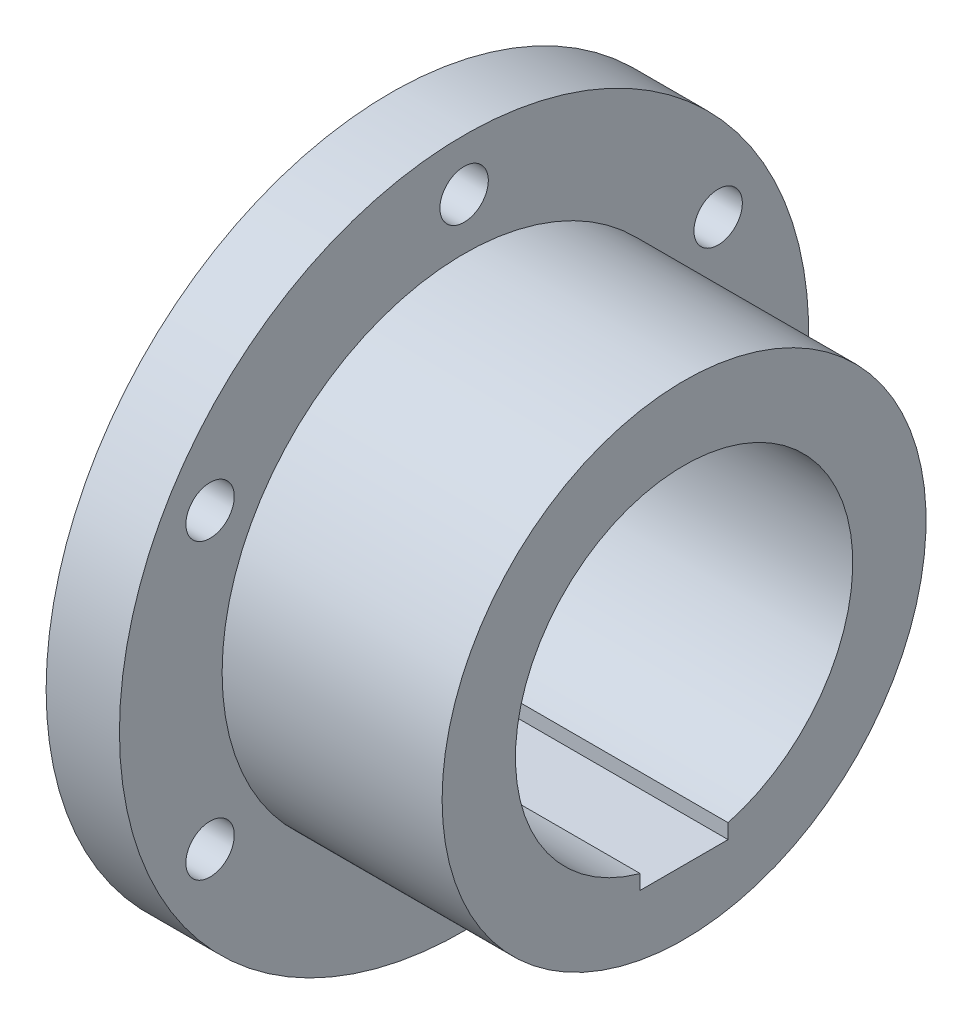
ISO-10303-21;
HEADER;
FILE_DESCRIPTION(('STEP AP214'),'2;1');
FILE_NAME('part.step','',(''),(''),'','','');
FILE_SCHEMA(('AUTOMOTIVE_DESIGN { 1 0 10303 214 1 1 1 1 }'));
ENDSEC;
DATA;
#1=APPLICATION_CONTEXT('core data for automotive mechanical design processes');
#2=APPLICATION_PROTOCOL_DEFINITION('international standard','automotive_design',2000,#1);
#3=PRODUCT_CONTEXT('',#1,'mechanical');
#4=PRODUCT('Part','Part','',(#3));
#5=PRODUCT_RELATED_PRODUCT_CATEGORY('part','',(#4));
#6=PRODUCT_DEFINITION_FORMATION('','',#4);
#7=PRODUCT_DEFINITION_CONTEXT('part definition',#1,'design');
#8=PRODUCT_DEFINITION('design','',#6,#7);
#9=PRODUCT_DEFINITION_SHAPE('','',#8);
#10=(LENGTH_UNIT() NAMED_UNIT(*) SI_UNIT(.MILLI.,.METRE.));
#11=(NAMED_UNIT(*) PLANE_ANGLE_UNIT() SI_UNIT($,.RADIAN.));
#12=(NAMED_UNIT(*) SI_UNIT($,.STERADIAN.) SOLID_ANGLE_UNIT());
#13=UNCERTAINTY_MEASURE_WITH_UNIT(LENGTH_MEASURE(1.E-05),#10,'distance_accuracy_value','');
#14=(GEOMETRIC_REPRESENTATION_CONTEXT(3) GLOBAL_UNCERTAINTY_ASSIGNED_CONTEXT((#13)) GLOBAL_UNIT_ASSIGNED_CONTEXT((#10,
#11,#12)) REPRESENTATION_CONTEXT('',''));
#15=CARTESIAN_POINT('',(0.,0.,0.));
#16=DIRECTION('',(0.,0.,1.));
#17=DIRECTION('',(1.,0.,0.));
#18=AXIS2_PLACEMENT_3D('',#15,#16,#17);
#19=CARTESIAN_POINT('',(9.2148511043888E-12,1.66533453693773E-13,-28.0000000000012));
#20=DIRECTION('',(1.,0.,0.));
#21=DIRECTION('',(0.,0.,-1.));
#22=AXIS2_PLACEMENT_3D('',#19,#20,#21);
#23=PLANE('',#22);
#24=DIRECTION('',(0.,0.,1.));
#25=VECTOR('',#24,1.);
#26=CARTESIAN_POINT('',(0.,-24.2036033111722,-6.00000000000106));
#27=LINE('',#26,#25);
#28=CARTESIAN_POINT('',(0.,-24.2036033111722,-6.00000000000106));
#29=VERTEX_POINT('',#28);
#30=CARTESIAN_POINT('',(4.66293670342566E-12,-24.2036033111722,5.99999999999928));
#31=VERTEX_POINT('',#30);
#32=EDGE_CURVE('E104',#29,#31,#27,.T.);
#33=ORIENTED_EDGE('',*,*,#32,.F.);
#34=DIRECTION('',(0.,-0.999999999999995,0.));
#35=VECTOR('',#34,1.);
#36=CARTESIAN_POINT('',(0.,-24.2036033111722,-6.00000000000106));
#37=LINE('',#36,#35);
#38=CARTESIAN_POINT('',(2.22044604925031E-13,-22.2036033111722,-6.00000000000114));
#39=VERTEX_POINT('',#38);
#40=EDGE_CURVE('E82',#39,#29,#37,.T.);
#41=ORIENTED_EDGE('',*,*,#40,.F.);
#42=CARTESIAN_POINT('',(0.,0.,0.));
#43=DIRECTION('',(-1.,0.,0.));
#44=DIRECTION('',(0.,0.,1.));
#45=AXIS2_PLACEMENT_3D('',#42,#43,#44);
#46=CIRCLE('',#45,23.);
#47=CARTESIAN_POINT('',(4.66293670342566E-12,-22.2036033111722,5.99999999999956));
#48=VERTEX_POINT('',#47);
#49=EDGE_CURVE('E11',#48,#39,#46,.T.);
#50=ORIENTED_EDGE('',*,*,#49,.F.);
#51=DIRECTION('',(0.,0.999999999999995,0.));
#52=VECTOR('',#51,1.);
#53=CARTESIAN_POINT('',(4.66293670342566E-12,-24.2036033111722,5.99999999999928));
#54=LINE('',#53,#52);
#55=EDGE_CURVE('E100',#31,#48,#54,.T.);
#56=ORIENTED_EDGE('',*,*,#55,.F.);
#57=EDGE_LOOP('',(#33,#41,#50,#56));
#58=FACE_BOUND('',#57,.T.);
#59=CARTESIAN_POINT('',(0.,0.,0.));
#60=DIRECTION('',(-1.,0.,0.));
#61=DIRECTION('',(0.,0.,1.));
#62=AXIS2_PLACEMENT_3D('',#59,#60,#61);
#63=CIRCLE('',#62,28.);
#64=CARTESIAN_POINT('',(0.,0.,28.));
#65=VERTEX_POINT('',#64);
#66=EDGE_CURVE('E169',#65,#65,#63,.T.);
#67=ORIENTED_EDGE('',*,*,#66,.T.);
#68=EDGE_LOOP('',(#67));
#69=FACE_BOUND('',#68,.T.);
#70=ADVANCED_FACE('F38',(#58,#69),#23,.F.);
#71=CARTESIAN_POINT('',(-31.1593830334144,0.,-6.38378239159465E-13));
#72=DIRECTION('',(-1.,0.,0.));
#73=DIRECTION('',(0.,0.,1.));
#74=AXIS2_PLACEMENT_3D('',#71,#72,#73);
#75=CYLINDRICAL_SURFACE('',#74,23.);
#76=ORIENTED_EDGE('',*,*,#49,.T.);
#77=DIRECTION('',(-1.,0.,0.));
#78=VECTOR('',#77,1.);
#79=CARTESIAN_POINT('',(46.0000000000046,-22.2036033111744,-6.00000000000145));
#80=LINE('',#79,#78);
#81=CARTESIAN_POINT('',(46.0000000000046,-22.2036033111744,-6.00000000000145));
#82=VERTEX_POINT('',#81);
#83=EDGE_CURVE('E77',#82,#39,#80,.T.);
#84=ORIENTED_EDGE('',*,*,#83,.F.);
#85=CARTESIAN_POINT('',(46.0000000000047,2.33146835171283E-12,-1.38777878078145E-12));
#86=DIRECTION('',(-1.,0.,0.));
#87=DIRECTION('',(0.,0.,1.));
#88=AXIS2_PLACEMENT_3D('',#85,#86,#87);
#89=CIRCLE('',#88,23.);
#90=CARTESIAN_POINT('',(46.0000000000047,-22.2036033111722,5.99999999999881));
#91=VERTEX_POINT('',#90);
#92=EDGE_CURVE('E46',#91,#82,#89,.T.);
#93=ORIENTED_EDGE('',*,*,#92,.F.);
#94=DIRECTION('',(-1.,0.,0.));
#95=VECTOR('',#94,1.);
#96=CARTESIAN_POINT('',(46.0000000000047,-22.2036033111722,5.99999999999881));
#97=LINE('',#96,#95);
#98=EDGE_CURVE('E116',#91,#48,#97,.T.);
#99=ORIENTED_EDGE('',*,*,#98,.T.);
#100=EDGE_LOOP('',(#76,#84,#93,#99));
#101=FACE_BOUND('',#100,.T.);
#102=ADVANCED_FACE('F223',(#101),#75,.F.);
#103=CARTESIAN_POINT('',(46.,2.33146835171283E-12,-23.0000000000007));
#104=DIRECTION('',(-1.,0.,0.));
#105=DIRECTION('',(0.,0.,1.));
#106=AXIS2_PLACEMENT_3D('',#103,#104,#105);
#107=PLANE('',#106);
#108=ORIENTED_EDGE('',*,*,#92,.T.);
#109=DIRECTION('',(0.,-0.999999999999995,0.));
#110=VECTOR('',#109,1.);
#111=CARTESIAN_POINT('',(46.0000000000046,-24.2036033111744,-6.00000000000034));
#112=LINE('',#111,#110);
#113=CARTESIAN_POINT('',(46.0000000000046,-24.2036033111744,-6.00000000000034));
#114=VERTEX_POINT('',#113);
#115=EDGE_CURVE('E62',#82,#114,#112,.T.);
#116=ORIENTED_EDGE('',*,*,#115,.T.);
#117=DIRECTION('',(0.,0.,1.));
#118=VECTOR('',#117,1.);
#119=CARTESIAN_POINT('',(46.0000000000046,-24.2036033111744,-6.00000000000034));
#120=LINE('',#119,#118);
#121=CARTESIAN_POINT('',(46.0000000000047,-24.2036033111722,5.9999999999997));
#122=VERTEX_POINT('',#121);
#123=EDGE_CURVE('E90',#114,#122,#120,.T.);
#124=ORIENTED_EDGE('',*,*,#123,.T.);
#125=DIRECTION('',(0.,0.999999999999995,0.));
#126=VECTOR('',#125,1.);
#127=CARTESIAN_POINT('',(46.0000000000047,-24.2036033111722,5.9999999999997));
#128=LINE('',#127,#126);
#129=EDGE_CURVE('E53',#122,#91,#128,.T.);
#130=ORIENTED_EDGE('',*,*,#129,.T.);
#131=EDGE_LOOP('',(#108,#116,#124,#130));
#132=FACE_BOUND('',#131,.T.);
#133=CARTESIAN_POINT('',(46.0000000000047,2.33146835171283E-12,-1.38777878078145E-12));
#134=DIRECTION('',(-1.,0.,0.));
#135=DIRECTION('',(0.,0.,1.));
#136=AXIS2_PLACEMENT_3D('',#133,#134,#135);
#137=CIRCLE('',#136,33.);
#138=CARTESIAN_POINT('',(46.0000000000047,2.33146835171283E-12,32.9999999999986));
#139=VERTEX_POINT('',#138);
#140=EDGE_CURVE('E189',#139,#139,#137,.T.);
#141=ORIENTED_EDGE('',*,*,#140,.F.);
#142=EDGE_LOOP('',(#141));
#143=FACE_BOUND('',#142,.T.);
#144=ADVANCED_FACE('F96',(#132,#143),#107,.F.);
#145=CARTESIAN_POINT('',(-31.1593830334144,0.,-6.38378239159465E-13));
#146=DIRECTION('',(-1.,0.,0.));
#147=DIRECTION('',(0.,0.,1.));
#148=AXIS2_PLACEMENT_3D('',#145,#146,#147);
#149=CYLINDRICAL_SURFACE('',#148,33.);
#150=CARTESIAN_POINT('',(16.0000000000041,2.33146835171283E-12,-3.88578058618805E-13));
#151=DIRECTION('',(-1.,0.,0.));
#152=DIRECTION('',(0.,0.,1.));
#153=AXIS2_PLACEMENT_3D('',#150,#151,#152);
#154=CIRCLE('',#153,33.);
#155=CARTESIAN_POINT('',(16.0000000000041,2.33146835171283E-12,32.9999999999996));
#156=VERTEX_POINT('',#155);
#157=EDGE_CURVE('E185',#156,#156,#154,.T.);
#158=ORIENTED_EDGE('',*,*,#157,.F.);
#159=EDGE_LOOP('',(#158));
#160=FACE_BOUND('',#159,.T.);
#161=ORIENTED_EDGE('',*,*,#140,.T.);
#162=EDGE_LOOP('',(#161));
#163=FACE_BOUND('',#162,.T.);
#164=ADVANCED_FACE('F221',(#160,#163),#149,.T.);
#165=CARTESIAN_POINT('',(16.,2.33146835171283E-12,-33.0000000000001));
#166=DIRECTION('',(-1.,0.,0.));
#167=DIRECTION('',(0.,0.,1.));
#168=AXIS2_PLACEMENT_3D('',#165,#166,#167);
#169=PLANE('',#168);
#170=CARTESIAN_POINT('',(16.0000000000041,40.0000000000024,-1.19348975147204E-12));
#171=DIRECTION('',(-1.,0.,0.));
#172=DIRECTION('',(0.,0.,1.));
#173=AXIS2_PLACEMENT_3D('',#170,#171,#172);
#174=CIRCLE('',#173,3.3);
#175=CARTESIAN_POINT('',(16.0000000000041,40.0000000000024,3.29999999999881));
#176=VERTEX_POINT('',#175);
#177=EDGE_CURVE('E165',#176,#176,#174,.T.);
#178=ORIENTED_EDGE('',*,*,#177,.T.);
#179=EDGE_LOOP('',(#178));
#180=FACE_BOUND('',#179,.T.);
#181=CARTESIAN_POINT('',(16.,20.0000000000006,-34.6410161513778));
#182=DIRECTION('',(-1.,0.,0.));
#183=DIRECTION('',(0.,0.,1.));
#184=AXIS2_PLACEMENT_3D('',#181,#182,#183);
#185=CIRCLE('',#184,3.3);
#186=CARTESIAN_POINT('',(16.,20.0000000000006,-31.3410161513778));
#187=VERTEX_POINT('',#186);
#188=EDGE_CURVE('E161',#187,#187,#185,.T.);
#189=ORIENTED_EDGE('',*,*,#188,.T.);
#190=EDGE_LOOP('',(#189));
#191=FACE_BOUND('',#190,.T.);
#192=CARTESIAN_POINT('',(16.0000000000009,-19.9999999999994,-34.6410161513761));
#193=DIRECTION('',(-1.,0.,0.));
#194=DIRECTION('',(0.,0.,1.));
#195=AXIS2_PLACEMENT_3D('',#192,#193,#194);
#196=CIRCLE('',#195,3.3);
#197=CARTESIAN_POINT('',(16.0000000000009,-19.9999999999994,-31.3410161513761));
#198=VERTEX_POINT('',#197);
#199=EDGE_CURVE('E157',#198,#198,#196,.T.);
#200=ORIENTED_EDGE('',*,*,#199,.T.);
#201=EDGE_LOOP('',(#200));
#202=FACE_BOUND('',#201,.T.);
#203=CARTESIAN_POINT('',(16.0000000000047,-39.9999999999976,3.38618022510673E-12));
#204=DIRECTION('',(-1.,0.,0.));
#205=DIRECTION('',(0.,0.,1.));
#206=AXIS2_PLACEMENT_3D('',#203,#204,#205);
#207=CIRCLE('',#206,3.3);
#208=CARTESIAN_POINT('',(16.0000000000047,-39.9999999999976,3.30000000000339));
#209=VERTEX_POINT('',#208);
#210=EDGE_CURVE('E153',#209,#209,#207,.T.);
#211=ORIENTED_EDGE('',*,*,#210,.T.);
#212=EDGE_LOOP('',(#211));
#213=FACE_BOUND('',#212,.T.);
#214=CARTESIAN_POINT('',(16.0000000000047,-19.999999999996,34.6410161513807));
#215=DIRECTION('',(-1.,0.,0.));
#216=DIRECTION('',(0.,0.,1.));
#217=AXIS2_PLACEMENT_3D('',#214,#215,#216);
#218=CIRCLE('',#217,3.3);
#219=CARTESIAN_POINT('',(16.0000000000047,-19.999999999996,37.9410161513807));
#220=VERTEX_POINT('',#219);
#221=EDGE_CURVE('E149',#220,#220,#218,.T.);
#222=ORIENTED_EDGE('',*,*,#221,.T.);
#223=EDGE_LOOP('',(#222));
#224=FACE_BOUND('',#223,.T.);
#225=CARTESIAN_POINT('',(16.0000000000047,20.000000000004,34.6410161513769));
#226=DIRECTION('',(-1.,0.,0.));
#227=DIRECTION('',(0.,0.,1.));
#228=AXIS2_PLACEMENT_3D('',#225,#226,#227);
#229=CIRCLE('',#228,3.3);
#230=CARTESIAN_POINT('',(16.0000000000047,20.000000000004,37.9410161513769));
#231=VERTEX_POINT('',#230);
#232=EDGE_CURVE('E126',#231,#231,#229,.T.);
#233=ORIENTED_EDGE('',*,*,#232,.T.);
#234=EDGE_LOOP('',(#233));
#235=FACE_BOUND('',#234,.T.);
#236=CARTESIAN_POINT('',(16.0000000000041,2.33146835171283E-12,-3.88578058618805E-13));
#237=DIRECTION('',(-1.,0.,0.));
#238=DIRECTION('',(0.,0.,1.));
#239=AXIS2_PLACEMENT_3D('',#236,#237,#238);
#240=CIRCLE('',#239,47.);
#241=CARTESIAN_POINT('',(16.0000000000041,2.33146835171283E-12,46.9999999999996));
#242=VERTEX_POINT('',#241);
#243=EDGE_CURVE('E181',#242,#242,#240,.T.);
#244=ORIENTED_EDGE('',*,*,#243,.F.);
#245=EDGE_LOOP('',(#244));
#246=FACE_BOUND('',#245,.T.);
#247=ORIENTED_EDGE('',*,*,#157,.T.);
#248=EDGE_LOOP('',(#247));
#249=FACE_BOUND('',#248,.T.);
#250=ADVANCED_FACE('F229',(#180,#191,#202,#213,#224,#235,#246,#249),#169,.F.);
#251=CARTESIAN_POINT('',(-31.1593830334144,0.,-6.38378239159465E-13));
#252=DIRECTION('',(-1.,0.,0.));
#253=DIRECTION('',(0.,0.,1.));
#254=AXIS2_PLACEMENT_3D('',#251,#252,#253);
#255=CYLINDRICAL_SURFACE('',#254,47.);
#256=CARTESIAN_POINT('',(6.00000000000001,0.,0.));
#257=DIRECTION('',(-1.,0.,0.));
#258=DIRECTION('',(0.,0.,1.));
#259=AXIS2_PLACEMENT_3D('',#256,#257,#258);
#260=CIRCLE('',#259,47.);
#261=CARTESIAN_POINT('',(6.00000000000001,0.,47.));
#262=VERTEX_POINT('',#261);
#263=EDGE_CURVE('E177',#262,#262,#260,.T.);
#264=ORIENTED_EDGE('',*,*,#263,.F.);
#265=EDGE_LOOP('',(#264));
#266=FACE_BOUND('',#265,.T.);
#267=ORIENTED_EDGE('',*,*,#243,.T.);
#268=EDGE_LOOP('',(#267));
#269=FACE_BOUND('',#268,.T.);
#270=ADVANCED_FACE('F251',(#266,#269),#255,.T.);
#271=CARTESIAN_POINT('',(6.00000000000001,2.33146835171283E-12,-47.0000000000012));
#272=DIRECTION('',(1.,0.,0.));
#273=DIRECTION('',(0.,0.,-1.));
#274=AXIS2_PLACEMENT_3D('',#271,#272,#273);
#275=PLANE('',#274);
#276=CARTESIAN_POINT('',(6.00000000000467,40.,-6.93889390390723E-13));
#277=DIRECTION('',(-1.,0.,0.));
#278=DIRECTION('',(0.,0.,1.));
#279=AXIS2_PLACEMENT_3D('',#276,#277,#278);
#280=CIRCLE('',#279,3.3);
#281=CARTESIAN_POINT('',(6.00000000000467,40.,3.29999999999931));
#282=VERTEX_POINT('',#281);
#283=EDGE_CURVE('E122',#282,#282,#280,.T.);
#284=ORIENTED_EDGE('',*,*,#283,.F.);
#285=EDGE_LOOP('',(#284));
#286=FACE_BOUND('',#285,.T.);
#287=CARTESIAN_POINT('',(6.00000000000456,19.9999999999984,-34.641016151377));
#288=DIRECTION('',(-1.,0.,0.));
#289=DIRECTION('',(0.,0.,1.));
#290=AXIS2_PLACEMENT_3D('',#287,#288,#289);
#291=CIRCLE('',#290,3.3);
#292=CARTESIAN_POINT('',(6.00000000000456,19.9999999999984,-31.341016151377));
#293=VERTEX_POINT('',#292);
#294=EDGE_CURVE('E115',#293,#293,#291,.T.);
#295=ORIENTED_EDGE('',*,*,#294,.F.);
#296=EDGE_LOOP('',(#295));
#297=FACE_BOUND('',#296,.T.);
#298=CARTESIAN_POINT('',(6.00000000000001,-19.9999999999994,-34.6410161513758));
#299=DIRECTION('',(-1.,0.,0.));
#300=DIRECTION('',(0.,0.,1.));
#301=AXIS2_PLACEMENT_3D('',#298,#299,#300);
#302=CIRCLE('',#301,3.3);
#303=CARTESIAN_POINT('',(6.00000000000001,-19.9999999999994,-31.3410161513758));
#304=VERTEX_POINT('',#303);
#305=EDGE_CURVE('E131',#304,#304,#302,.T.);
#306=ORIENTED_EDGE('',*,*,#305,.F.);
#307=EDGE_LOOP('',(#306));
#308=FACE_BOUND('',#307,.T.);
#309=CARTESIAN_POINT('',(5.99999999999945,-39.9999999999976,2.692290834716E-12));
#310=DIRECTION('',(-1.,0.,0.));
#311=DIRECTION('',(0.,0.,1.));
#312=AXIS2_PLACEMENT_3D('',#309,#310,#311);
#313=CIRCLE('',#312,3.3);
#314=CARTESIAN_POINT('',(5.99999999999945,-39.9999999999976,3.30000000000269));
#315=VERTEX_POINT('',#314);
#316=EDGE_CURVE('E139',#315,#315,#313,.T.);
#317=ORIENTED_EDGE('',*,*,#316,.F.);
#318=EDGE_LOOP('',(#317));
#319=FACE_BOUND('',#318,.T.);
#320=CARTESIAN_POINT('',(6.00000000000467,-19.9999999999983,34.6410161513791));
#321=DIRECTION('',(-1.,0.,0.));
#322=DIRECTION('',(0.,0.,1.));
#323=AXIS2_PLACEMENT_3D('',#320,#321,#322);
#324=CIRCLE('',#323,3.3);
#325=CARTESIAN_POINT('',(6.00000000000467,-19.9999999999983,37.9410161513791));
#326=VERTEX_POINT('',#325);
#327=EDGE_CURVE('E135',#326,#326,#324,.T.);
#328=ORIENTED_EDGE('',*,*,#327,.F.);
#329=EDGE_LOOP('',(#328));
#330=FACE_BOUND('',#329,.T.);
#331=CARTESIAN_POINT('',(6.00000000000467,20.0000000000017,34.6410161513773));
#332=DIRECTION('',(-1.,0.,0.));
#333=DIRECTION('',(0.,0.,1.));
#334=AXIS2_PLACEMENT_3D('',#331,#332,#333);
#335=CIRCLE('',#334,3.3);
#336=CARTESIAN_POINT('',(6.00000000000467,20.0000000000017,37.9410161513773));
#337=VERTEX_POINT('',#336);
#338=EDGE_CURVE('E127',#337,#337,#335,.T.);
#339=ORIENTED_EDGE('',*,*,#338,.F.);
#340=EDGE_LOOP('',(#339));
#341=FACE_BOUND('',#340,.T.);
#342=CARTESIAN_POINT('',(6.00000000000001,0.,0.));
#343=DIRECTION('',(-1.,0.,0.));
#344=DIRECTION('',(0.,0.,1.));
#345=AXIS2_PLACEMENT_3D('',#342,#343,#344);
#346=CIRCLE('',#345,28.);
#347=CARTESIAN_POINT('',(6.00000000000001,0.,28.));
#348=VERTEX_POINT('',#347);
#349=EDGE_CURVE('E173',#348,#348,#346,.T.);
#350=ORIENTED_EDGE('',*,*,#349,.F.);
#351=EDGE_LOOP('',(#350));
#352=FACE_BOUND('',#351,.T.);
#353=ORIENTED_EDGE('',*,*,#263,.T.);
#354=EDGE_LOOP('',(#353));
#355=FACE_BOUND('',#354,.T.);
#356=ADVANCED_FACE('F245',(#286,#297,#308,#319,#330,#341,#352,#355),#275,.F.);
#357=CARTESIAN_POINT('',(-31.1593830334144,0.,-6.38378239159465E-13));
#358=DIRECTION('',(-1.,0.,0.));
#359=DIRECTION('',(0.,0.,1.));
#360=AXIS2_PLACEMENT_3D('',#357,#358,#359);
#361=CYLINDRICAL_SURFACE('',#360,28.);
#362=ORIENTED_EDGE('',*,*,#66,.F.);
#363=EDGE_LOOP('',(#362));
#364=FACE_BOUND('',#363,.T.);
#365=ORIENTED_EDGE('',*,*,#349,.T.);
#366=EDGE_LOOP('',(#365));
#367=FACE_BOUND('',#366,.T.);
#368=ADVANCED_FACE('F241',(#364,#367),#361,.T.);
#369=CARTESIAN_POINT('',(46.,20.000000000004,34.6410161513785));
#370=DIRECTION('',(-1.,0.,0.));
#371=DIRECTION('',(0.,0.,1.));
#372=AXIS2_PLACEMENT_3D('',#369,#370,#371);
#373=CYLINDRICAL_SURFACE('',#372,3.3);
#374=ORIENTED_EDGE('',*,*,#338,.T.);
#375=EDGE_LOOP('',(#374));
#376=FACE_BOUND('',#375,.T.);
#377=ORIENTED_EDGE('',*,*,#232,.F.);
#378=EDGE_LOOP('',(#377));
#379=FACE_BOUND('',#378,.T.);
#380=ADVANCED_FACE('F244',(#376,#379),#373,.F.);
#381=CARTESIAN_POINT('',(46.,-19.9999999999982,34.6410161513804));
#382=DIRECTION('',(-1.,0.,0.));
#383=DIRECTION('',(0.,0.,1.));
#384=AXIS2_PLACEMENT_3D('',#381,#382,#383);
#385=CYLINDRICAL_SURFACE('',#384,3.3);
#386=ORIENTED_EDGE('',*,*,#327,.T.);
#387=EDGE_LOOP('',(#386));
#388=FACE_BOUND('',#387,.T.);
#389=ORIENTED_EDGE('',*,*,#221,.F.);
#390=EDGE_LOOP('',(#389));
#391=FACE_BOUND('',#390,.T.);
#392=ADVANCED_FACE('F278',(#388,#391),#385,.F.);
#393=CARTESIAN_POINT('',(46.0000000000093,-40.,3.46944695195361E-12));
#394=DIRECTION('',(-1.,0.,0.));
#395=DIRECTION('',(0.,0.,1.));
#396=AXIS2_PLACEMENT_3D('',#393,#394,#395);
#397=CYLINDRICAL_SURFACE('',#396,3.3);
#398=ORIENTED_EDGE('',*,*,#316,.T.);
#399=EDGE_LOOP('',(#398));
#400=FACE_BOUND('',#399,.T.);
#401=ORIENTED_EDGE('',*,*,#210,.F.);
#402=EDGE_LOOP('',(#401));
#403=FACE_BOUND('',#402,.T.);
#404=ADVANCED_FACE('F274',(#400,#403),#397,.F.);
#405=CARTESIAN_POINT('',(46.0000000000046,-20.0000000000017,-34.6410161513757));
#406=DIRECTION('',(-1.,0.,0.));
#407=DIRECTION('',(0.,0.,1.));
#408=AXIS2_PLACEMENT_3D('',#405,#406,#407);
#409=CYLINDRICAL_SURFACE('',#408,3.3);
#410=ORIENTED_EDGE('',*,*,#305,.T.);
#411=EDGE_LOOP('',(#410));
#412=FACE_BOUND('',#411,.T.);
#413=ORIENTED_EDGE('',*,*,#199,.F.);
#414=EDGE_LOOP('',(#413));
#415=FACE_BOUND('',#414,.T.);
#416=ADVANCED_FACE('F270',(#412,#415),#409,.F.);
#417=CARTESIAN_POINT('',(46.0000000000047,19.9999999999983,-34.6410161513774));
#418=DIRECTION('',(-1.,0.,0.));
#419=DIRECTION('',(0.,0.,1.));
#420=AXIS2_PLACEMENT_3D('',#417,#418,#419);
#421=CYLINDRICAL_SURFACE('',#420,3.3);
#422=ORIENTED_EDGE('',*,*,#294,.T.);
#423=EDGE_LOOP('',(#422));
#424=FACE_BOUND('',#423,.T.);
#425=ORIENTED_EDGE('',*,*,#188,.F.);
#426=EDGE_LOOP('',(#425));
#427=FACE_BOUND('',#426,.T.);
#428=ADVANCED_FACE('F273',(#424,#427),#421,.F.);
#429=CARTESIAN_POINT('',(46.0000000000047,40.0000000000001,-1.08246744900953E-12));
#430=DIRECTION('',(-1.,0.,0.));
#431=DIRECTION('',(0.,0.,1.));
#432=AXIS2_PLACEMENT_3D('',#429,#430,#431);
#433=CYLINDRICAL_SURFACE('',#432,3.3);
#434=ORIENTED_EDGE('',*,*,#283,.T.);
#435=EDGE_LOOP('',(#434));
#436=FACE_BOUND('',#435,.T.);
#437=ORIENTED_EDGE('',*,*,#177,.F.);
#438=EDGE_LOOP('',(#437));
#439=FACE_BOUND('',#438,.T.);
#440=ADVANCED_FACE('F288',(#436,#439),#433,.F.);
#441=CARTESIAN_POINT('',(46.0000000000046,-24.2036033111744,-6.00000000000034));
#442=DIRECTION('',(0.,0.,-1.));
#443=DIRECTION('',(-1.,0.,0.));
#444=AXIS2_PLACEMENT_3D('',#441,#442,#443);
#445=PLANE('',#444);
#446=ORIENTED_EDGE('',*,*,#40,.T.);
#447=DIRECTION('',(-1.,0.,0.));
#448=VECTOR('',#447,1.);
#449=CARTESIAN_POINT('',(46.0000000000046,-24.2036033111744,-6.00000000000034));
#450=LINE('',#449,#448);
#451=EDGE_CURVE('E79',#114,#29,#450,.T.);
#452=ORIENTED_EDGE('',*,*,#451,.F.);
#453=ORIENTED_EDGE('',*,*,#115,.F.);
#454=ORIENTED_EDGE('',*,*,#83,.T.);
#455=EDGE_LOOP('',(#446,#452,#453,#454));
#456=FACE_BOUND('',#455,.T.);
#457=ADVANCED_FACE('F81',(#456),#445,.F.);
#458=CARTESIAN_POINT('',(46.0000000000047,-24.2036033111722,5.9999999999997));
#459=DIRECTION('',(0.,0.,1.));
#460=DIRECTION('',(1.,0.,0.));
#461=AXIS2_PLACEMENT_3D('',#458,#459,#460);
#462=PLANE('',#461);
#463=ORIENTED_EDGE('',*,*,#55,.T.);
#464=ORIENTED_EDGE('',*,*,#98,.F.);
#465=ORIENTED_EDGE('',*,*,#129,.F.);
#466=DIRECTION('',(-1.,0.,0.));
#467=VECTOR('',#466,1.);
#468=CARTESIAN_POINT('',(46.0000000000047,-24.2036033111722,5.9999999999997));
#469=LINE('',#468,#467);
#470=EDGE_CURVE('E87',#122,#31,#469,.T.);
#471=ORIENTED_EDGE('',*,*,#470,.T.);
#472=EDGE_LOOP('',(#463,#464,#465,#471));
#473=FACE_BOUND('',#472,.T.);
#474=ADVANCED_FACE('F295',(#473),#462,.F.);
#475=CARTESIAN_POINT('',(46.0000000000046,-24.2036033111744,-6.00000000000034));
#476=DIRECTION('',(0.,-0.999999999999995,0.));
#477=DIRECTION('',(0.,0.,-1.));
#478=AXIS2_PLACEMENT_3D('',#475,#476,#477);
#479=PLANE('',#478);
#480=ORIENTED_EDGE('',*,*,#32,.T.);
#481=ORIENTED_EDGE('',*,*,#470,.F.);
#482=ORIENTED_EDGE('',*,*,#123,.F.);
#483=ORIENTED_EDGE('',*,*,#451,.T.);
#484=EDGE_LOOP('',(#480,#481,#482,#483));
#485=FACE_BOUND('',#484,.T.);
#486=ADVANCED_FACE('F91',(#485),#479,.F.);
#487=CLOSED_SHELL('',(#70,#102,#144,#164,#250,#270,#356,#368,#380,#392,#404,#416,#428,#440,#457,
#474,#486));
#488=MANIFOLD_SOLID_BREP('B2',#487);
#489=ADVANCED_BREP_SHAPE_REPRESENTATION('',(#18,#488),#14);
#490=SHAPE_DEFINITION_REPRESENTATION(#9,#489);
ENDSEC;
END-ISO-10303-21;
